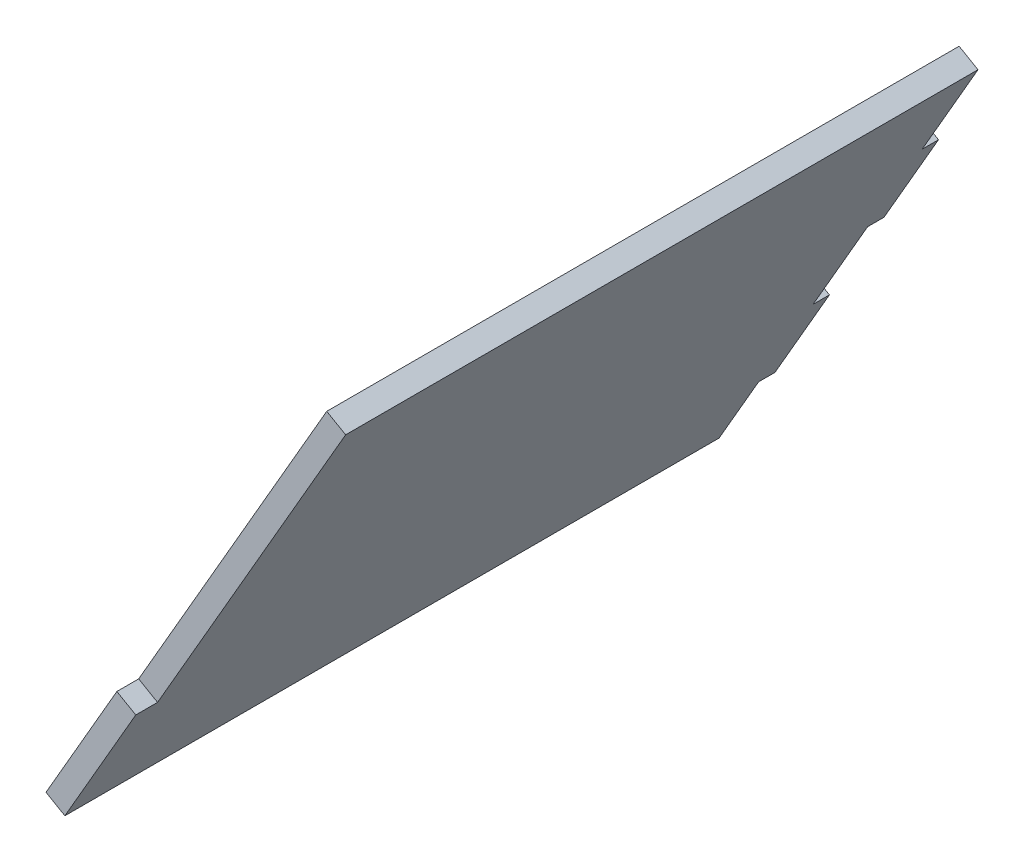
ISO-10303-21;
HEADER;
FILE_DESCRIPTION(('STEP AP214'),'2;1');
FILE_NAME('part.step','',(''),(''),'','','');
FILE_SCHEMA(('AUTOMOTIVE_DESIGN { 1 0 10303 214 1 1 1 1 }'));
ENDSEC;
DATA;
#1=APPLICATION_CONTEXT('core data for automotive mechanical design processes');
#2=APPLICATION_PROTOCOL_DEFINITION('international standard','automotive_design',2000,#1);
#3=PRODUCT_CONTEXT('',#1,'mechanical');
#4=PRODUCT('Part','Part','',(#3));
#5=PRODUCT_RELATED_PRODUCT_CATEGORY('part','',(#4));
#6=PRODUCT_DEFINITION_FORMATION('','',#4);
#7=PRODUCT_DEFINITION_CONTEXT('part definition',#1,'design');
#8=PRODUCT_DEFINITION('design','',#6,#7);
#9=PRODUCT_DEFINITION_SHAPE('','',#8);
#10=(LENGTH_UNIT() NAMED_UNIT(*) SI_UNIT(.MILLI.,.METRE.));
#11=(NAMED_UNIT(*) PLANE_ANGLE_UNIT() SI_UNIT($,.RADIAN.));
#12=(NAMED_UNIT(*) SI_UNIT($,.STERADIAN.) SOLID_ANGLE_UNIT());
#13=UNCERTAINTY_MEASURE_WITH_UNIT(LENGTH_MEASURE(1.E-05),#10,'distance_accuracy_value','');
#14=(GEOMETRIC_REPRESENTATION_CONTEXT(3) GLOBAL_UNCERTAINTY_ASSIGNED_CONTEXT((#13)) GLOBAL_UNIT_ASSIGNED_CONTEXT((#10,
#11,#12)) REPRESENTATION_CONTEXT('',''));
#15=CARTESIAN_POINT('',(0.,0.,0.));
#16=DIRECTION('',(0.,0.,1.));
#17=DIRECTION('',(1.,0.,0.));
#18=AXIS2_PLACEMENT_3D('',#15,#16,#17);
#19=CARTESIAN_POINT('',(26.6884452121285,148.244247138874,120.));
#20=DIRECTION('',(-0.499999999999998,-0.86602540378444,0.));
#21=DIRECTION('',(0.,0.,-1.));
#22=AXIS2_PLACEMENT_3D('',#19,#20,#21);
#23=PLANE('',#22);
#24=DIRECTION('',(0.86602540378444,-0.499999999999998,0.));
#25=VECTOR('',#24,1.);
#26=CARTESIAN_POINT('',(26.6884452121285,148.244247138874,116.));
#27=LINE('',#26,#25);
#28=CARTESIAN_POINT('',(23.2243435969907,150.244247138874,116.));
#29=VERTEX_POINT('',#28);
#30=CARTESIAN_POINT('',(26.6884452121285,148.244247138874,116.));
#31=VERTEX_POINT('',#30);
#32=EDGE_CURVE('E11',#29,#31,#27,.T.);
#33=ORIENTED_EDGE('',*,*,#32,.F.);
#34=DIRECTION('',(0.,0.,1.));
#35=VECTOR('',#34,1.);
#36=CARTESIAN_POINT('',(23.2243435969907,150.244247138874,214.484411491749));
#37=LINE('',#36,#35);
#38=CARTESIAN_POINT('',(23.2243435969907,150.244247138874,120.));
#39=VERTEX_POINT('',#38);
#40=EDGE_CURVE('E122',#39,#29,#37,.F.);
#41=ORIENTED_EDGE('',*,*,#40,.F.);
#42=DIRECTION('',(0.86602540378444,-0.499999999999998,0.));
#43=VECTOR('',#42,1.);
#44=CARTESIAN_POINT('',(26.6884452121285,148.244247138874,120.));
#45=LINE('',#44,#43);
#46=CARTESIAN_POINT('',(26.6884452121285,148.244247138874,120.));
#47=VERTEX_POINT('',#46);
#48=EDGE_CURVE('E47',#39,#47,#45,.T.);
#49=ORIENTED_EDGE('',*,*,#48,.T.);
#50=DIRECTION('',(0.,0.,-1.));
#51=VECTOR('',#50,1.);
#52=CARTESIAN_POINT('',(26.6884452121285,148.244247138874,120.));
#53=LINE('',#52,#51);
#54=EDGE_CURVE('E197',#47,#31,#53,.T.);
#55=ORIENTED_EDGE('',*,*,#54,.T.);
#56=EDGE_LOOP('',(#33,#41,#49,#55));
#57=FACE_BOUND('',#56,.T.);
#58=ADVANCED_FACE('F37',(#57),#23,.F.);
#59=CARTESIAN_POINT('',(13.6884452121285,125.727586640478,120.));
#60=DIRECTION('',(0.,0.,-1.));
#61=DIRECTION('',(0.5,0.866025403784438,0.));
#62=AXIS2_PLACEMENT_3D('',#59,#60,#61);
#63=PLANE('',#62);
#64=ORIENTED_EDGE('',*,*,#48,.F.);
#65=DIRECTION('',(0.499999999999998,0.86602540378444,0.));
#66=VECTOR('',#65,1.);
#67=CARTESIAN_POINT('',(57.7243435969906,210.,120.));
#68=LINE('',#67,#66);
#69=CARTESIAN_POINT('',(10.2243435969907,127.727586640478,120.));
#70=VERTEX_POINT('',#69);
#71=EDGE_CURVE('E160',#70,#39,#68,.T.);
#72=ORIENTED_EDGE('',*,*,#71,.F.);
#73=DIRECTION('',(0.86602540378444,-0.499999999999998,0.));
#74=VECTOR('',#73,1.);
#75=CARTESIAN_POINT('',(13.6884452121285,125.727586640478,120.));
#76=LINE('',#75,#74);
#77=CARTESIAN_POINT('',(13.6884452121285,125.727586640478,120.));
#78=VERTEX_POINT('',#77);
#79=EDGE_CURVE('E190',#70,#78,#76,.T.);
#80=ORIENTED_EDGE('',*,*,#79,.T.);
#81=DIRECTION('',(0.5,0.866025403784438,0.));
#82=VECTOR('',#81,1.);
#83=CARTESIAN_POINT('',(13.6884452121285,125.727586640478,120.));
#84=LINE('',#83,#82);
#85=EDGE_CURVE('E207',#78,#47,#84,.T.);
#86=ORIENTED_EDGE('',*,*,#85,.T.);
#87=EDGE_LOOP('',(#64,#72,#80,#86));
#88=FACE_BOUND('',#87,.T.);
#89=ADVANCED_FACE('F210',(#88),#63,.F.);
#90=CARTESIAN_POINT('',(13.6884452121285,125.727586640478,214.484411491749));
#91=DIRECTION('',(-0.499999999999998,-0.86602540378444,0.));
#92=DIRECTION('',(0.,0.,-1.));
#93=AXIS2_PLACEMENT_3D('',#90,#91,#92);
#94=PLANE('',#93);
#95=ORIENTED_EDGE('',*,*,#79,.F.);
#96=DIRECTION('',(0.,0.,1.));
#97=VECTOR('',#96,1.);
#98=CARTESIAN_POINT('',(10.2243435969907,127.727586640478,214.484411491749));
#99=LINE('',#98,#97);
#100=CARTESIAN_POINT('',(10.2243435969907,127.727586640478,-1.11022302462516E-13));
#101=VERTEX_POINT('',#100);
#102=EDGE_CURVE('E157',#70,#101,#99,.F.);
#103=ORIENTED_EDGE('',*,*,#102,.T.);
#104=DIRECTION('',(0.86602540378444,-0.499999999999998,0.));
#105=VECTOR('',#104,1.);
#106=CARTESIAN_POINT('',(13.6884452121285,125.727586640478,0.));
#107=LINE('',#106,#105);
#108=CARTESIAN_POINT('',(13.6884452121285,125.727586640478,0.));
#109=VERTEX_POINT('',#108);
#110=EDGE_CURVE('E187',#101,#109,#107,.T.);
#111=ORIENTED_EDGE('',*,*,#110,.T.);
#112=DIRECTION('',(0.,0.,-1.));
#113=VECTOR('',#112,1.);
#114=CARTESIAN_POINT('',(13.6884452121285,125.727586640478,214.484411491749));
#115=LINE('',#114,#113);
#116=EDGE_CURVE('E211',#78,#109,#115,.T.);
#117=ORIENTED_EDGE('',*,*,#116,.F.);
#118=EDGE_LOOP('',(#95,#103,#111,#117));
#119=FACE_BOUND('',#118,.T.);
#120=ADVANCED_FACE('F272',(#119),#94,.T.);
#121=CARTESIAN_POINT('',(61.1884452121283,208.,0.));
#122=DIRECTION('',(0.,0.,1.));
#123=DIRECTION('',(-0.499999999999998,-0.86602540378444,0.));
#124=AXIS2_PLACEMENT_3D('',#121,#122,#123);
#125=PLANE('',#124);
#126=ORIENTED_EDGE('',*,*,#110,.F.);
#127=DIRECTION('',(0.499999999999998,0.86602540378444,0.));
#128=VECTOR('',#127,1.);
#129=CARTESIAN_POINT('',(57.7243435969906,210.,-1.11022302462516E-13));
#130=LINE('',#129,#128);
#131=CARTESIAN_POINT('',(17.4743435969907,140.284954995353,-1.11022302462516E-13));
#132=VERTEX_POINT('',#131);
#133=EDGE_CURVE('E154',#132,#101,#130,.F.);
#134=ORIENTED_EDGE('',*,*,#133,.F.);
#135=DIRECTION('',(0.86602540378444,-0.499999999999998,0.));
#136=VECTOR('',#135,1.);
#137=CARTESIAN_POINT('',(20.9384452121285,138.284954995353,0.));
#138=LINE('',#137,#136);
#139=CARTESIAN_POINT('',(20.9384452121285,138.284954995353,0.));
#140=VERTEX_POINT('',#139);
#141=EDGE_CURVE('E184',#132,#140,#138,.T.);
#142=ORIENTED_EDGE('',*,*,#141,.T.);
#143=DIRECTION('',(-0.499999999999998,-0.86602540378444,0.));
#144=VECTOR('',#143,1.);
#145=CARTESIAN_POINT('',(61.1884452121283,208.,0.));
#146=LINE('',#145,#144);
#147=EDGE_CURVE('E213',#140,#109,#146,.T.);
#148=ORIENTED_EDGE('',*,*,#147,.T.);
#149=EDGE_LOOP('',(#126,#134,#142,#148));
#150=FACE_BOUND('',#149,.T.);
#151=ADVANCED_FACE('F278',(#150),#125,.F.);
#152=CARTESIAN_POINT('',(20.9384452121285,138.284954995353,-3.));
#153=DIRECTION('',(0.499999999999998,0.86602540378444,0.));
#154=DIRECTION('',(0.,0.,1.));
#155=AXIS2_PLACEMENT_3D('',#152,#153,#154);
#156=PLANE('',#155);
#157=ORIENTED_EDGE('',*,*,#141,.F.);
#158=DIRECTION('',(0.,0.,1.));
#159=VECTOR('',#158,1.);
#160=CARTESIAN_POINT('',(17.4743435969907,140.284954995352,214.484411491749));
#161=LINE('',#160,#159);
#162=CARTESIAN_POINT('',(17.4743435969907,140.284954995352,-3.00000000000011));
#163=VERTEX_POINT('',#162);
#164=EDGE_CURVE('E151',#163,#132,#161,.T.);
#165=ORIENTED_EDGE('',*,*,#164,.F.);
#166=DIRECTION('',(0.86602540378444,-0.499999999999998,0.));
#167=VECTOR('',#166,1.);
#168=CARTESIAN_POINT('',(20.9384452121285,138.284954995353,-3.));
#169=LINE('',#168,#167);
#170=CARTESIAN_POINT('',(20.9384452121285,138.284954995353,-3.));
#171=VERTEX_POINT('',#170);
#172=EDGE_CURVE('E181',#163,#171,#169,.T.);
#173=ORIENTED_EDGE('',*,*,#172,.T.);
#174=DIRECTION('',(0.,0.,1.));
#175=VECTOR('',#174,1.);
#176=CARTESIAN_POINT('',(20.9384452121285,138.284954995353,-3.));
#177=LINE('',#176,#175);
#178=EDGE_CURVE('E219',#171,#140,#177,.T.);
#179=ORIENTED_EDGE('',*,*,#178,.T.);
#180=EDGE_LOOP('',(#157,#165,#173,#179));
#181=FACE_BOUND('',#180,.T.);
#182=ADVANCED_FACE('F281',(#181),#156,.F.);
#183=CARTESIAN_POINT('',(30.9384452121284,155.605463071041,-3.));
#184=DIRECTION('',(0.,0.,1.));
#185=DIRECTION('',(-0.499999999999999,-0.866025403784439,0.));
#186=AXIS2_PLACEMENT_3D('',#183,#184,#185);
#187=PLANE('',#186);
#188=ORIENTED_EDGE('',*,*,#172,.F.);
#189=DIRECTION('',(0.499999999999998,0.86602540378444,0.));
#190=VECTOR('',#189,1.);
#191=CARTESIAN_POINT('',(57.7243435969906,210.,-3.00000000000011));
#192=LINE('',#191,#190);
#193=CARTESIAN_POINT('',(27.4743435969907,157.605463071041,-3.00000000000011));
#194=VERTEX_POINT('',#193);
#195=EDGE_CURVE('E148',#194,#163,#192,.F.);
#196=ORIENTED_EDGE('',*,*,#195,.F.);
#197=DIRECTION('',(0.86602540378444,-0.499999999999998,0.));
#198=VECTOR('',#197,1.);
#199=CARTESIAN_POINT('',(30.9384452121284,155.605463071041,-3.));
#200=LINE('',#199,#198);
#201=CARTESIAN_POINT('',(30.9384452121284,155.605463071041,-3.));
#202=VERTEX_POINT('',#201);
#203=EDGE_CURVE('E178',#194,#202,#200,.T.);
#204=ORIENTED_EDGE('',*,*,#203,.T.);
#205=DIRECTION('',(-0.499999999999999,-0.866025403784439,0.));
#206=VECTOR('',#205,1.);
#207=CARTESIAN_POINT('',(30.9384452121284,155.605463071041,-3.));
#208=LINE('',#207,#206);
#209=EDGE_CURVE('E223',#202,#171,#208,.T.);
#210=ORIENTED_EDGE('',*,*,#209,.T.);
#211=EDGE_LOOP('',(#188,#196,#204,#210));
#212=FACE_BOUND('',#211,.T.);
#213=ADVANCED_FACE('F285',(#212),#187,.F.);
#214=CARTESIAN_POINT('',(30.9384452121284,155.605463071041,-3.));
#215=DIRECTION('',(0.499999999999998,0.86602540378444,0.));
#216=DIRECTION('',(0.,0.,1.));
#217=AXIS2_PLACEMENT_3D('',#214,#215,#216);
#218=PLANE('',#217);
#219=ORIENTED_EDGE('',*,*,#203,.F.);
#220=DIRECTION('',(0.,0.,1.));
#221=VECTOR('',#220,1.);
#222=CARTESIAN_POINT('',(27.4743435969907,157.605463071041,214.484411491749));
#223=LINE('',#222,#221);
#224=CARTESIAN_POINT('',(27.4743435969907,157.605463071041,-1.11022302462516E-13));
#225=VERTEX_POINT('',#224);
#226=EDGE_CURVE('E145',#194,#225,#223,.T.);
#227=ORIENTED_EDGE('',*,*,#226,.T.);
#228=DIRECTION('',(0.86602540378444,-0.499999999999998,0.));
#229=VECTOR('',#228,1.);
#230=CARTESIAN_POINT('',(30.9384452121284,155.605463071041,0.));
#231=LINE('',#230,#229);
#232=CARTESIAN_POINT('',(30.9384452121284,155.605463071041,0.));
#233=VERTEX_POINT('',#232);
#234=EDGE_CURVE('E175',#225,#233,#231,.T.);
#235=ORIENTED_EDGE('',*,*,#234,.T.);
#236=DIRECTION('',(0.,0.,1.));
#237=VECTOR('',#236,1.);
#238=CARTESIAN_POINT('',(30.9384452121284,155.605463071041,-3.));
#239=LINE('',#238,#237);
#240=EDGE_CURVE('E226',#202,#233,#239,.T.);
#241=ORIENTED_EDGE('',*,*,#240,.F.);
#242=EDGE_LOOP('',(#219,#227,#235,#241));
#243=FACE_BOUND('',#242,.T.);
#244=ADVANCED_FACE('F287',(#243),#218,.T.);
#245=ORIENTED_EDGE('',*,*,#234,.F.);
#246=DIRECTION('',(0.499999999999998,0.86602540378444,0.));
#247=VECTOR('',#246,1.);
#248=CARTESIAN_POINT('',(57.7243435969906,210.,-1.11022302462516E-13));
#249=LINE('',#248,#247);
#250=CARTESIAN_POINT('',(37.4743435969906,174.92597114673,-1.11022302462516E-13));
#251=VERTEX_POINT('',#250);
#252=EDGE_CURVE('E142',#251,#225,#249,.F.);
#253=ORIENTED_EDGE('',*,*,#252,.F.);
#254=DIRECTION('',(0.86602540378444,-0.499999999999998,0.));
#255=VECTOR('',#254,1.);
#256=CARTESIAN_POINT('',(40.9384452121284,172.92597114673,0.));
#257=LINE('',#256,#255);
#258=CARTESIAN_POINT('',(40.9384452121284,172.92597114673,0.));
#259=VERTEX_POINT('',#258);
#260=EDGE_CURVE('E172',#251,#259,#257,.T.);
#261=ORIENTED_EDGE('',*,*,#260,.T.);
#262=EDGE_CURVE('E220',#259,#233,#146,.T.);
#263=ORIENTED_EDGE('',*,*,#262,.T.);
#264=EDGE_LOOP('',(#245,#253,#261,#263));
#265=FACE_BOUND('',#264,.T.);
#266=ADVANCED_FACE('F243',(#265),#125,.F.);
#267=CARTESIAN_POINT('',(40.9384452121284,172.92597114673,-3.));
#268=DIRECTION('',(0.499999999999998,0.86602540378444,0.));
#269=DIRECTION('',(0.,0.,1.));
#270=AXIS2_PLACEMENT_3D('',#267,#268,#269);
#271=PLANE('',#270);
#272=ORIENTED_EDGE('',*,*,#260,.F.);
#273=DIRECTION('',(0.,0.,1.));
#274=VECTOR('',#273,1.);
#275=CARTESIAN_POINT('',(37.4743435969906,174.92597114673,214.484411491749));
#276=LINE('',#275,#274);
#277=CARTESIAN_POINT('',(37.4743435969906,174.92597114673,-3.00000000000011));
#278=VERTEX_POINT('',#277);
#279=EDGE_CURVE('E139',#278,#251,#276,.T.);
#280=ORIENTED_EDGE('',*,*,#279,.F.);
#281=DIRECTION('',(0.86602540378444,-0.499999999999998,0.));
#282=VECTOR('',#281,1.);
#283=CARTESIAN_POINT('',(40.9384452121284,172.92597114673,-3.));
#284=LINE('',#283,#282);
#285=CARTESIAN_POINT('',(40.9384452121284,172.92597114673,-3.));
#286=VERTEX_POINT('',#285);
#287=EDGE_CURVE('E169',#278,#286,#284,.T.);
#288=ORIENTED_EDGE('',*,*,#287,.T.);
#289=DIRECTION('',(0.,0.,1.));
#290=VECTOR('',#289,1.);
#291=CARTESIAN_POINT('',(40.9384452121284,172.92597114673,-3.));
#292=LINE('',#291,#290);
#293=EDGE_CURVE('E229',#286,#259,#292,.T.);
#294=ORIENTED_EDGE('',*,*,#293,.T.);
#295=EDGE_LOOP('',(#272,#280,#288,#294));
#296=FACE_BOUND('',#295,.T.);
#297=ADVANCED_FACE('F253',(#296),#271,.F.);
#298=CARTESIAN_POINT('',(50.9384452121284,190.246479222419,-3.));
#299=DIRECTION('',(0.,0.,1.));
#300=DIRECTION('',(-0.499999999999998,-0.86602540378444,0.));
#301=AXIS2_PLACEMENT_3D('',#298,#299,#300);
#302=PLANE('',#301);
#303=ORIENTED_EDGE('',*,*,#287,.F.);
#304=DIRECTION('',(0.499999999999998,0.86602540378444,0.));
#305=VECTOR('',#304,1.);
#306=CARTESIAN_POINT('',(57.7243435969906,210.,-3.00000000000011));
#307=LINE('',#306,#305);
#308=CARTESIAN_POINT('',(47.4743435969906,192.246479222419,-3.00000000000011));
#309=VERTEX_POINT('',#308);
#310=EDGE_CURVE('E136',#309,#278,#307,.F.);
#311=ORIENTED_EDGE('',*,*,#310,.F.);
#312=DIRECTION('',(0.86602540378444,-0.499999999999998,0.));
#313=VECTOR('',#312,1.);
#314=CARTESIAN_POINT('',(50.9384452121284,190.246479222419,-3.));
#315=LINE('',#314,#313);
#316=CARTESIAN_POINT('',(50.9384452121284,190.246479222419,-3.));
#317=VERTEX_POINT('',#316);
#318=EDGE_CURVE('E166',#309,#317,#315,.T.);
#319=ORIENTED_EDGE('',*,*,#318,.T.);
#320=DIRECTION('',(-0.499999999999998,-0.86602540378444,0.));
#321=VECTOR('',#320,1.);
#322=CARTESIAN_POINT('',(50.9384452121284,190.246479222419,-3.));
#323=LINE('',#322,#321);
#324=EDGE_CURVE('E231',#317,#286,#323,.T.);
#325=ORIENTED_EDGE('',*,*,#324,.T.);
#326=EDGE_LOOP('',(#303,#311,#319,#325));
#327=FACE_BOUND('',#326,.T.);
#328=ADVANCED_FACE('F257',(#327),#302,.F.);
#329=CARTESIAN_POINT('',(50.9384452121284,190.246479222419,-3.));
#330=DIRECTION('',(0.499999999999998,0.86602540378444,0.));
#331=DIRECTION('',(0.,0.,1.));
#332=AXIS2_PLACEMENT_3D('',#329,#330,#331);
#333=PLANE('',#332);
#334=ORIENTED_EDGE('',*,*,#318,.F.);
#335=DIRECTION('',(0.,0.,1.));
#336=VECTOR('',#335,1.);
#337=CARTESIAN_POINT('',(47.4743435969906,192.246479222419,214.484411491749));
#338=LINE('',#337,#336);
#339=CARTESIAN_POINT('',(47.4743435969906,192.246479222419,-1.11022302462516E-13));
#340=VERTEX_POINT('',#339);
#341=EDGE_CURVE('E133',#309,#340,#338,.T.);
#342=ORIENTED_EDGE('',*,*,#341,.T.);
#343=DIRECTION('',(0.86602540378444,-0.499999999999998,0.));
#344=VECTOR('',#343,1.);
#345=CARTESIAN_POINT('',(50.9384452121284,190.246479222419,0.));
#346=LINE('',#345,#344);
#347=CARTESIAN_POINT('',(50.9384452121284,190.246479222419,0.));
#348=VERTEX_POINT('',#347);
#349=EDGE_CURVE('E164',#340,#348,#346,.T.);
#350=ORIENTED_EDGE('',*,*,#349,.T.);
#351=DIRECTION('',(0.,0.,1.));
#352=VECTOR('',#351,1.);
#353=CARTESIAN_POINT('',(50.9384452121284,190.246479222419,-3.));
#354=LINE('',#353,#352);
#355=EDGE_CURVE('E128',#317,#348,#354,.T.);
#356=ORIENTED_EDGE('',*,*,#355,.F.);
#357=EDGE_LOOP('',(#334,#342,#350,#356));
#358=FACE_BOUND('',#357,.T.);
#359=ADVANCED_FACE('F260',(#358),#333,.T.);
#360=ORIENTED_EDGE('',*,*,#349,.F.);
#361=DIRECTION('',(0.499999999999998,0.86602540378444,0.));
#362=VECTOR('',#361,1.);
#363=CARTESIAN_POINT('',(57.7243435969906,210.,-1.11022302462516E-13));
#364=LINE('',#363,#362);
#365=CARTESIAN_POINT('',(57.7243435969906,210.,-1.11022302462516E-13));
#366=VERTEX_POINT('',#365);
#367=EDGE_CURVE('E130',#366,#340,#364,.F.);
#368=ORIENTED_EDGE('',*,*,#367,.F.);
#369=DIRECTION('',(0.86602540378444,-0.499999999999998,0.));
#370=VECTOR('',#369,1.);
#371=CARTESIAN_POINT('',(61.1884452121283,208.,0.));
#372=LINE('',#371,#370);
#373=CARTESIAN_POINT('',(61.1884452121283,208.,0.));
#374=VERTEX_POINT('',#373);
#375=EDGE_CURVE('E55',#366,#374,#372,.T.);
#376=ORIENTED_EDGE('',*,*,#375,.T.);
#377=EDGE_CURVE('E115',#374,#348,#146,.T.);
#378=ORIENTED_EDGE('',*,*,#377,.T.);
#379=EDGE_LOOP('',(#360,#368,#376,#378));
#380=FACE_BOUND('',#379,.T.);
#381=ADVANCED_FACE('F295',(#380),#125,.F.);
#382=CARTESIAN_POINT('',(61.1884452121283,208.,214.484411491749));
#383=DIRECTION('',(-0.499999999999998,-0.86602540378444,0.));
#384=DIRECTION('',(0.,0.,-1.));
#385=AXIS2_PLACEMENT_3D('',#382,#383,#384);
#386=PLANE('',#385);
#387=ORIENTED_EDGE('',*,*,#375,.F.);
#388=DIRECTION('',(0.,0.,1.));
#389=VECTOR('',#388,1.);
#390=CARTESIAN_POINT('',(57.7243435969906,210.,214.484411491749));
#391=LINE('',#390,#389);
#392=CARTESIAN_POINT('',(57.7243435969906,210.,116.));
#393=VERTEX_POINT('',#392);
#394=EDGE_CURVE('E120',#393,#366,#391,.F.);
#395=ORIENTED_EDGE('',*,*,#394,.F.);
#396=DIRECTION('',(0.86602540378444,-0.499999999999998,0.));
#397=VECTOR('',#396,1.);
#398=CARTESIAN_POINT('',(61.1884452121283,208.,116.));
#399=LINE('',#398,#397);
#400=CARTESIAN_POINT('',(61.1884452121283,208.,116.));
#401=VERTEX_POINT('',#400);
#402=EDGE_CURVE('E41',#393,#401,#399,.T.);
#403=ORIENTED_EDGE('',*,*,#402,.T.);
#404=DIRECTION('',(0.,0.,-1.));
#405=VECTOR('',#404,1.);
#406=CARTESIAN_POINT('',(61.1884452121283,208.,214.484411491749));
#407=LINE('',#406,#405);
#408=EDGE_CURVE('E132',#401,#374,#407,.T.);
#409=ORIENTED_EDGE('',*,*,#408,.T.);
#410=EDGE_LOOP('',(#387,#395,#403,#409));
#411=FACE_BOUND('',#410,.T.);
#412=ADVANCED_FACE('F124',(#411),#386,.F.);
#413=CARTESIAN_POINT('',(61.1884452121283,208.,116.));
#414=DIRECTION('',(0.,0.,-1.));
#415=DIRECTION('',(0.499999999999998,0.86602540378444,0.));
#416=AXIS2_PLACEMENT_3D('',#413,#414,#415);
#417=PLANE('',#416);
#418=DIRECTION('',(0.499999999999998,0.86602540378444,0.));
#419=VECTOR('',#418,1.);
#420=CARTESIAN_POINT('',(57.7243435969906,210.,116.));
#421=LINE('',#420,#419);
#422=EDGE_CURVE('E109',#29,#393,#421,.T.);
#423=ORIENTED_EDGE('',*,*,#422,.F.);
#424=ORIENTED_EDGE('',*,*,#32,.T.);
#425=DIRECTION('',(0.499999999999998,0.86602540378444,0.));
#426=VECTOR('',#425,1.);
#427=CARTESIAN_POINT('',(61.1884452121283,208.,116.));
#428=LINE('',#427,#426);
#429=EDGE_CURVE('E111',#31,#401,#428,.T.);
#430=ORIENTED_EDGE('',*,*,#429,.T.);
#431=ORIENTED_EDGE('',*,*,#402,.F.);
#432=EDGE_LOOP('',(#423,#424,#430,#431));
#433=FACE_BOUND('',#432,.T.);
#434=ADVANCED_FACE('F39',(#433),#417,.F.);
#435=CARTESIAN_POINT('',(61.1884452121283,208.,214.484411491749));
#436=DIRECTION('',(0.86602540378444,-0.499999999999998,0.));
#437=DIRECTION('',(0.499999999999998,0.86602540378444,0.));
#438=AXIS2_PLACEMENT_3D('',#435,#436,#437);
#439=PLANE('',#438);
#440=ORIENTED_EDGE('',*,*,#408,.F.);
#441=ORIENTED_EDGE('',*,*,#429,.F.);
#442=ORIENTED_EDGE('',*,*,#54,.F.);
#443=ORIENTED_EDGE('',*,*,#85,.F.);
#444=ORIENTED_EDGE('',*,*,#116,.T.);
#445=ORIENTED_EDGE('',*,*,#147,.F.);
#446=ORIENTED_EDGE('',*,*,#178,.F.);
#447=ORIENTED_EDGE('',*,*,#209,.F.);
#448=ORIENTED_EDGE('',*,*,#240,.T.);
#449=ORIENTED_EDGE('',*,*,#262,.F.);
#450=ORIENTED_EDGE('',*,*,#293,.F.);
#451=ORIENTED_EDGE('',*,*,#324,.F.);
#452=ORIENTED_EDGE('',*,*,#355,.T.);
#453=ORIENTED_EDGE('',*,*,#377,.F.);
#454=EDGE_LOOP('',(#440,#441,#442,#443,#444,#445,#446,#447,#448,#449,#450,#451,#452,#453));
#455=FACE_BOUND('',#454,.T.);
#456=ADVANCED_FACE('F205',(#455),#439,.T.);
#457=CARTESIAN_POINT('',(57.7243435969906,210.,214.484411491749));
#458=DIRECTION('',(0.86602540378444,-0.499999999999998,0.));
#459=DIRECTION('',(0.499999999999998,0.86602540378444,0.));
#460=AXIS2_PLACEMENT_3D('',#457,#458,#459);
#461=PLANE('',#460);
#462=ORIENTED_EDGE('',*,*,#394,.T.);
#463=ORIENTED_EDGE('',*,*,#367,.T.);
#464=ORIENTED_EDGE('',*,*,#341,.F.);
#465=ORIENTED_EDGE('',*,*,#310,.T.);
#466=ORIENTED_EDGE('',*,*,#279,.T.);
#467=ORIENTED_EDGE('',*,*,#252,.T.);
#468=ORIENTED_EDGE('',*,*,#226,.F.);
#469=ORIENTED_EDGE('',*,*,#195,.T.);
#470=ORIENTED_EDGE('',*,*,#164,.T.);
#471=ORIENTED_EDGE('',*,*,#133,.T.);
#472=ORIENTED_EDGE('',*,*,#102,.F.);
#473=ORIENTED_EDGE('',*,*,#71,.T.);
#474=ORIENTED_EDGE('',*,*,#40,.T.);
#475=ORIENTED_EDGE('',*,*,#422,.T.);
#476=EDGE_LOOP('',(#462,#463,#464,#465,#466,#467,#468,#469,#470,#471,#472,#473,#474,#475));
#477=FACE_BOUND('',#476,.T.);
#478=ADVANCED_FACE('F118',(#477),#461,.F.);
#479=CLOSED_SHELL('',(#58,#89,#120,#151,#182,#213,#244,#266,#297,#328,#359,#381,#412,#434,#456,#478));
#480=MANIFOLD_SOLID_BREP('B2',#479);
#481=ADVANCED_BREP_SHAPE_REPRESENTATION('',(#18,#480),#14);
#482=SHAPE_DEFINITION_REPRESENTATION(#9,#481);
ENDSEC;
END-ISO-10303-21;
